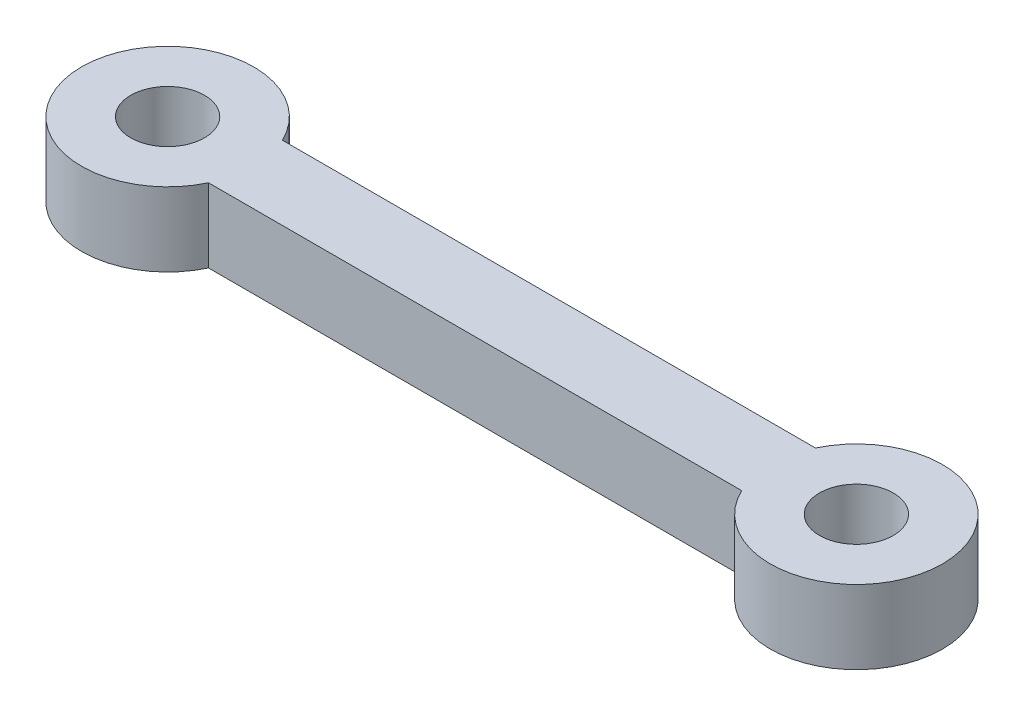
ISO-10303-21;
HEADER;
FILE_DESCRIPTION(('STEP AP214'),'2;1');
FILE_NAME('part.step','',(''),(''),'','','');
FILE_SCHEMA(('AUTOMOTIVE_DESIGN { 1 0 10303 214 1 1 1 1 }'));
ENDSEC;
DATA;
#1=APPLICATION_CONTEXT('core data for automotive mechanical design processes');
#2=APPLICATION_PROTOCOL_DEFINITION('international standard','automotive_design',2000,#1);
#3=PRODUCT_CONTEXT('',#1,'mechanical');
#4=PRODUCT('Part','Part','',(#3));
#5=PRODUCT_RELATED_PRODUCT_CATEGORY('part','',(#4));
#6=PRODUCT_DEFINITION_FORMATION('','',#4);
#7=PRODUCT_DEFINITION_CONTEXT('part definition',#1,'design');
#8=PRODUCT_DEFINITION('design','',#6,#7);
#9=PRODUCT_DEFINITION_SHAPE('','',#8);
#10=(LENGTH_UNIT() NAMED_UNIT(*) SI_UNIT(.MILLI.,.METRE.));
#11=(NAMED_UNIT(*) PLANE_ANGLE_UNIT() SI_UNIT($,.RADIAN.));
#12=(NAMED_UNIT(*) SI_UNIT($,.STERADIAN.) SOLID_ANGLE_UNIT());
#13=UNCERTAINTY_MEASURE_WITH_UNIT(LENGTH_MEASURE(1.E-05),#10,'distance_accuracy_value','');
#14=(GEOMETRIC_REPRESENTATION_CONTEXT(3) GLOBAL_UNCERTAINTY_ASSIGNED_CONTEXT((#13)) GLOBAL_UNIT_ASSIGNED_CONTEXT((#10,
#11,#12)) REPRESENTATION_CONTEXT('',''));
#15=CARTESIAN_POINT('',(0.,0.,0.));
#16=DIRECTION('',(0.,0.,1.));
#17=DIRECTION('',(1.,0.,0.));
#18=AXIS2_PLACEMENT_3D('',#15,#16,#17);
#19=CARTESIAN_POINT('',(28.,3.,0.));
#20=DIRECTION('',(0.,-1.,0.));
#21=DIRECTION('',(0.,0.,-1.));
#22=AXIS2_PLACEMENT_3D('',#19,#20,#21);
#23=CYLINDRICAL_SURFACE('',#22,3.5);
#24=CARTESIAN_POINT('',(28.,0.,0.));
#25=DIRECTION('',(0.,1.,0.));
#26=DIRECTION('',(0.,0.,1.));
#27=AXIS2_PLACEMENT_3D('',#24,#25,#26);
#28=CIRCLE('',#27,3.5);
#29=CARTESIAN_POINT('',(24.8377223398316,0.,1.5));
#30=VERTEX_POINT('',#29);
#31=CARTESIAN_POINT('',(24.8377223398316,0.,-1.5));
#32=VERTEX_POINT('',#31);
#33=EDGE_CURVE('E95',#30,#32,#28,.T.);
#34=ORIENTED_EDGE('',*,*,#33,.T.);
#35=DIRECTION('',(0.,-1.,0.));
#36=VECTOR('',#35,1.);
#37=CARTESIAN_POINT('',(24.8377223398316,3.,-1.5));
#38=LINE('',#37,#36);
#39=CARTESIAN_POINT('',(24.8377223398316,3.,-1.5));
#40=VERTEX_POINT('',#39);
#41=EDGE_CURVE('E11',#40,#32,#38,.T.);
#42=ORIENTED_EDGE('',*,*,#41,.F.);
#43=CARTESIAN_POINT('',(28.,3.,0.));
#44=DIRECTION('',(0.,1.,0.));
#45=DIRECTION('',(0.,0.,1.));
#46=AXIS2_PLACEMENT_3D('',#43,#44,#45);
#47=CIRCLE('',#46,3.5);
#48=CARTESIAN_POINT('',(24.8377223398316,3.,1.5));
#49=VERTEX_POINT('',#48);
#50=EDGE_CURVE('E83',#49,#40,#47,.T.);
#51=ORIENTED_EDGE('',*,*,#50,.F.);
#52=DIRECTION('',(0.,-1.,0.));
#53=VECTOR('',#52,1.);
#54=CARTESIAN_POINT('',(24.8377223398316,3.,1.5));
#55=LINE('',#54,#53);
#56=EDGE_CURVE('E91',#49,#30,#55,.T.);
#57=ORIENTED_EDGE('',*,*,#56,.T.);
#58=EDGE_LOOP('',(#34,#42,#51,#57));
#59=FACE_BOUND('',#58,.T.);
#60=ADVANCED_FACE('F32',(#59),#23,.T.);
#61=CARTESIAN_POINT('',(3.16227766016838,3.,-1.5));
#62=DIRECTION('',(0.,0.,1.));
#63=DIRECTION('',(1.,0.,0.));
#64=AXIS2_PLACEMENT_3D('',#61,#62,#63);
#65=PLANE('',#64);
#66=DIRECTION('',(-1.,0.,0.));
#67=VECTOR('',#66,1.);
#68=CARTESIAN_POINT('',(3.16227766016838,0.,-1.5));
#69=LINE('',#68,#67);
#70=CARTESIAN_POINT('',(3.16227766016838,0.,-1.5));
#71=VERTEX_POINT('',#70);
#72=EDGE_CURVE('E87',#32,#71,#69,.T.);
#73=ORIENTED_EDGE('',*,*,#72,.T.);
#74=DIRECTION('',(0.,-1.,0.));
#75=VECTOR('',#74,1.);
#76=CARTESIAN_POINT('',(3.16227766016838,3.,-1.5));
#77=LINE('',#76,#75);
#78=CARTESIAN_POINT('',(3.16227766016838,3.,-1.5));
#79=VERTEX_POINT('',#78);
#80=EDGE_CURVE('E40',#79,#71,#77,.T.);
#81=ORIENTED_EDGE('',*,*,#80,.F.);
#82=DIRECTION('',(-1.,0.,0.));
#83=VECTOR('',#82,1.);
#84=CARTESIAN_POINT('',(3.16227766016838,3.,-1.5));
#85=LINE('',#84,#83);
#86=EDGE_CURVE('E78',#40,#79,#85,.T.);
#87=ORIENTED_EDGE('',*,*,#86,.F.);
#88=ORIENTED_EDGE('',*,*,#41,.T.);
#89=EDGE_LOOP('',(#73,#81,#87,#88));
#90=FACE_BOUND('',#89,.T.);
#91=ADVANCED_FACE('F86',(#90),#65,.F.);
#92=CARTESIAN_POINT('',(0.,3.,0.));
#93=DIRECTION('',(0.,-1.,0.));
#94=DIRECTION('',(0.,0.,-1.));
#95=AXIS2_PLACEMENT_3D('',#92,#93,#94);
#96=CYLINDRICAL_SURFACE('',#95,3.5);
#97=CARTESIAN_POINT('',(0.,0.,0.));
#98=DIRECTION('',(0.,1.,0.));
#99=DIRECTION('',(0.,0.,1.));
#100=AXIS2_PLACEMENT_3D('',#97,#98,#99);
#101=CIRCLE('',#100,3.5);
#102=CARTESIAN_POINT('',(3.16227766016838,0.,1.5));
#103=VERTEX_POINT('',#102);
#104=EDGE_CURVE('E65',#71,#103,#101,.T.);
#105=ORIENTED_EDGE('',*,*,#104,.T.);
#106=DIRECTION('',(0.,-1.,0.));
#107=VECTOR('',#106,1.);
#108=CARTESIAN_POINT('',(3.16227766016838,3.,1.5));
#109=LINE('',#108,#107);
#110=CARTESIAN_POINT('',(3.16227766016838,3.,1.5));
#111=VERTEX_POINT('',#110);
#112=EDGE_CURVE('E88',#111,#103,#109,.T.);
#113=ORIENTED_EDGE('',*,*,#112,.F.);
#114=CARTESIAN_POINT('',(0.,3.,0.));
#115=DIRECTION('',(0.,1.,0.));
#116=DIRECTION('',(0.,0.,1.));
#117=AXIS2_PLACEMENT_3D('',#114,#115,#116);
#118=CIRCLE('',#117,3.5);
#119=EDGE_CURVE('E81',#79,#111,#118,.T.);
#120=ORIENTED_EDGE('',*,*,#119,.F.);
#121=ORIENTED_EDGE('',*,*,#80,.T.);
#122=EDGE_LOOP('',(#105,#113,#120,#121));
#123=FACE_BOUND('',#122,.T.);
#124=ADVANCED_FACE('F89',(#123),#96,.T.);
#125=CARTESIAN_POINT('',(3.16227766016838,3.,1.5));
#126=DIRECTION('',(0.,0.,-1.));
#127=DIRECTION('',(-1.,0.,0.));
#128=AXIS2_PLACEMENT_3D('',#125,#126,#127);
#129=PLANE('',#128);
#130=DIRECTION('',(1.,0.,0.));
#131=VECTOR('',#130,1.);
#132=CARTESIAN_POINT('',(3.16227766016838,0.,1.5));
#133=LINE('',#132,#131);
#134=EDGE_CURVE('E71',#103,#30,#133,.T.);
#135=ORIENTED_EDGE('',*,*,#134,.T.);
#136=ORIENTED_EDGE('',*,*,#56,.F.);
#137=DIRECTION('',(1.,0.,0.));
#138=VECTOR('',#137,1.);
#139=CARTESIAN_POINT('',(3.16227766016838,3.,1.5));
#140=LINE('',#139,#138);
#141=EDGE_CURVE('E48',#111,#49,#140,.T.);
#142=ORIENTED_EDGE('',*,*,#141,.F.);
#143=ORIENTED_EDGE('',*,*,#112,.T.);
#144=EDGE_LOOP('',(#135,#136,#142,#143));
#145=FACE_BOUND('',#144,.T.);
#146=ADVANCED_FACE('F103',(#145),#129,.F.);
#147=CARTESIAN_POINT('',(28.,3.,0.));
#148=DIRECTION('',(0.,1.,0.));
#149=DIRECTION('',(0.,0.,1.));
#150=AXIS2_PLACEMENT_3D('',#147,#148,#149);
#151=PLANE('',#150);
#152=CARTESIAN_POINT('',(0.,3.,0.));
#153=DIRECTION('',(0.,1.,0.));
#154=DIRECTION('',(0.,0.,1.));
#155=AXIS2_PLACEMENT_3D('',#152,#153,#154);
#156=CIRCLE('',#155,1.5);
#157=CARTESIAN_POINT('',(0.,3.,1.5));
#158=VERTEX_POINT('',#157);
#159=EDGE_CURVE('E115',#158,#158,#156,.T.);
#160=ORIENTED_EDGE('',*,*,#159,.F.);
#161=EDGE_LOOP('',(#160));
#162=FACE_BOUND('',#161,.T.);
#163=CARTESIAN_POINT('',(28.,3.,0.));
#164=DIRECTION('',(0.,1.,0.));
#165=DIRECTION('',(0.,0.,1.));
#166=AXIS2_PLACEMENT_3D('',#163,#164,#165);
#167=CIRCLE('',#166,1.5);
#168=CARTESIAN_POINT('',(28.,3.,1.5));
#169=VERTEX_POINT('',#168);
#170=EDGE_CURVE('E109',#169,#169,#167,.T.);
#171=ORIENTED_EDGE('',*,*,#170,.F.);
#172=EDGE_LOOP('',(#171));
#173=FACE_BOUND('',#172,.T.);
#174=ORIENTED_EDGE('',*,*,#50,.T.);
#175=ORIENTED_EDGE('',*,*,#86,.T.);
#176=ORIENTED_EDGE('',*,*,#119,.T.);
#177=ORIENTED_EDGE('',*,*,#141,.T.);
#178=EDGE_LOOP('',(#174,#175,#176,#177));
#179=FACE_BOUND('',#178,.T.);
#180=ADVANCED_FACE('F79',(#162,#173,#179),#151,.T.);
#181=CARTESIAN_POINT('',(28.,0.,0.));
#182=DIRECTION('',(0.,1.,0.));
#183=DIRECTION('',(0.,0.,1.));
#184=AXIS2_PLACEMENT_3D('',#181,#182,#183);
#185=PLANE('',#184);
#186=CARTESIAN_POINT('',(0.,0.,0.));
#187=DIRECTION('',(0.,1.,0.));
#188=DIRECTION('',(0.,0.,1.));
#189=AXIS2_PLACEMENT_3D('',#186,#187,#188);
#190=CIRCLE('',#189,1.5);
#191=CARTESIAN_POINT('',(0.,0.,1.5));
#192=VERTEX_POINT('',#191);
#193=EDGE_CURVE('E98',#192,#192,#190,.T.);
#194=ORIENTED_EDGE('',*,*,#193,.T.);
#195=EDGE_LOOP('',(#194));
#196=FACE_BOUND('',#195,.T.);
#197=CARTESIAN_POINT('',(28.,0.,0.));
#198=DIRECTION('',(0.,1.,0.));
#199=DIRECTION('',(0.,0.,1.));
#200=AXIS2_PLACEMENT_3D('',#197,#198,#199);
#201=CIRCLE('',#200,1.5);
#202=CARTESIAN_POINT('',(28.,0.,1.5));
#203=VERTEX_POINT('',#202);
#204=EDGE_CURVE('E112',#203,#203,#201,.T.);
#205=ORIENTED_EDGE('',*,*,#204,.T.);
#206=EDGE_LOOP('',(#205));
#207=FACE_BOUND('',#206,.T.);
#208=ORIENTED_EDGE('',*,*,#33,.F.);
#209=ORIENTED_EDGE('',*,*,#134,.F.);
#210=ORIENTED_EDGE('',*,*,#104,.F.);
#211=ORIENTED_EDGE('',*,*,#72,.F.);
#212=EDGE_LOOP('',(#208,#209,#210,#211));
#213=FACE_BOUND('',#212,.T.);
#214=ADVANCED_FACE('F106',(#196,#207,#213),#185,.F.);
#215=CARTESIAN_POINT('',(28.,0.,0.));
#216=DIRECTION('',(0.,1.,0.));
#217=DIRECTION('',(0.,0.,1.));
#218=AXIS2_PLACEMENT_3D('',#215,#216,#217);
#219=CYLINDRICAL_SURFACE('',#218,1.5);
#220=ORIENTED_EDGE('',*,*,#204,.F.);
#221=EDGE_LOOP('',(#220));
#222=FACE_BOUND('',#221,.T.);
#223=ORIENTED_EDGE('',*,*,#170,.T.);
#224=EDGE_LOOP('',(#223));
#225=FACE_BOUND('',#224,.T.);
#226=ADVANCED_FACE('F126',(#222,#225),#219,.F.);
#227=CARTESIAN_POINT('',(0.,0.,0.));
#228=DIRECTION('',(0.,1.,0.));
#229=DIRECTION('',(0.,0.,1.));
#230=AXIS2_PLACEMENT_3D('',#227,#228,#229);
#231=CYLINDRICAL_SURFACE('',#230,1.5);
#232=ORIENTED_EDGE('',*,*,#193,.F.);
#233=EDGE_LOOP('',(#232));
#234=FACE_BOUND('',#233,.T.);
#235=ORIENTED_EDGE('',*,*,#159,.T.);
#236=EDGE_LOOP('',(#235));
#237=FACE_BOUND('',#236,.T.);
#238=ADVANCED_FACE('F123',(#234,#237),#231,.F.);
#239=CLOSED_SHELL('',(#60,#91,#124,#146,#180,#214,#226,#238));
#240=MANIFOLD_SOLID_BREP('B2',#239);
#241=ADVANCED_BREP_SHAPE_REPRESENTATION('',(#18,#240),#14);
#242=SHAPE_DEFINITION_REPRESENTATION(#9,#241);
ENDSEC;
END-ISO-10303-21;
